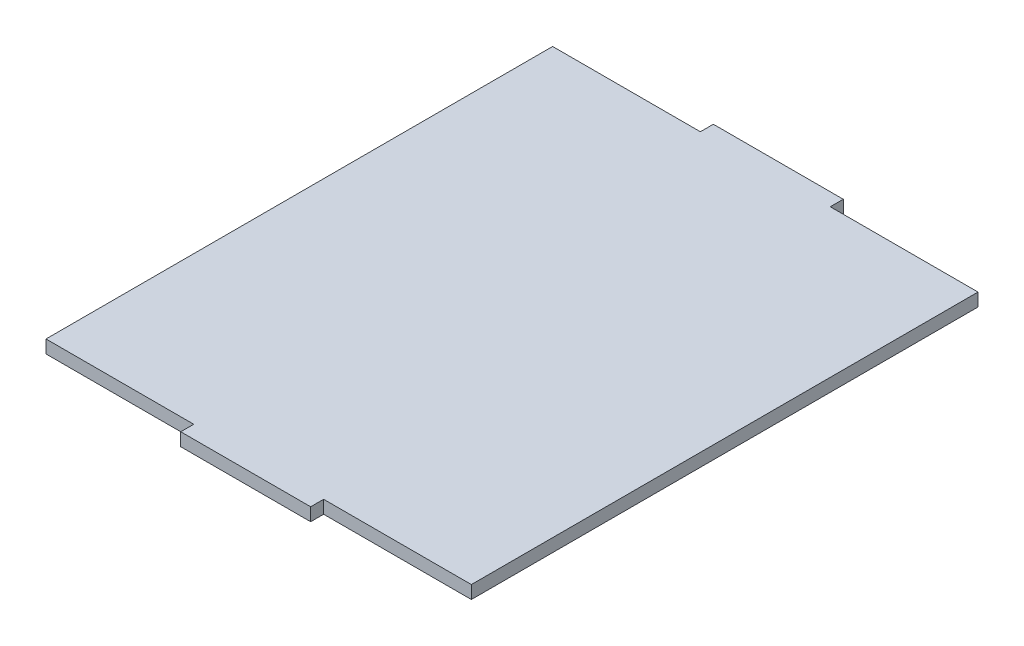
ISO-10303-21;
HEADER;
FILE_DESCRIPTION(('STEP AP214'),'2;1');
FILE_NAME('part.step','',(''),(''),'','','');
FILE_SCHEMA(('AUTOMOTIVE_DESIGN { 1 0 10303 214 1 1 1 1 }'));
ENDSEC;
DATA;
#1=APPLICATION_CONTEXT('core data for automotive mechanical design processes');
#2=APPLICATION_PROTOCOL_DEFINITION('international standard','automotive_design',2000,#1);
#3=PRODUCT_CONTEXT('',#1,'mechanical');
#4=PRODUCT('Part','Part','',(#3));
#5=PRODUCT_RELATED_PRODUCT_CATEGORY('part','',(#4));
#6=PRODUCT_DEFINITION_FORMATION('','',#4);
#7=PRODUCT_DEFINITION_CONTEXT('part definition',#1,'design');
#8=PRODUCT_DEFINITION('design','',#6,#7);
#9=PRODUCT_DEFINITION_SHAPE('','',#8);
#10=(LENGTH_UNIT() NAMED_UNIT(*) SI_UNIT(.MILLI.,.METRE.));
#11=(NAMED_UNIT(*) PLANE_ANGLE_UNIT() SI_UNIT($,.RADIAN.));
#12=(NAMED_UNIT(*) SI_UNIT($,.STERADIAN.) SOLID_ANGLE_UNIT());
#13=UNCERTAINTY_MEASURE_WITH_UNIT(LENGTH_MEASURE(1.E-05),#10,'distance_accuracy_value','');
#14=(GEOMETRIC_REPRESENTATION_CONTEXT(3) GLOBAL_UNCERTAINTY_ASSIGNED_CONTEXT((#13)) GLOBAL_UNIT_ASSIGNED_CONTEXT((#10,
#11,#12)) REPRESENTATION_CONTEXT('',''));
#15=CARTESIAN_POINT('',(0.,0.,0.));
#16=DIRECTION('',(0.,0.,1.));
#17=DIRECTION('',(1.,0.,0.));
#18=AXIS2_PLACEMENT_3D('',#15,#16,#17);
#19=CARTESIAN_POINT('',(-60.5023781779952,3.,-76.3083130287571));
#20=DIRECTION('',(1.,0.,0.));
#21=DIRECTION('',(0.,0.,-1.));
#22=AXIS2_PLACEMENT_3D('',#19,#20,#21);
#23=PLANE('',#22);
#24=DIRECTION('',(0.,0.,1.));
#25=VECTOR('',#24,1.);
#26=CARTESIAN_POINT('',(-60.5023781779952,0.,-76.3083130287571));
#27=LINE('',#26,#25);
#28=CARTESIAN_POINT('',(-60.5023781779952,0.,-76.3083130287571));
#29=VERTEX_POINT('',#28);
#30=CARTESIAN_POINT('',(-60.5023781779952,0.,40.691686971243));
#31=VERTEX_POINT('',#30);
#32=EDGE_CURVE('E153',#29,#31,#27,.T.);
#33=ORIENTED_EDGE('',*,*,#32,.T.);
#34=DIRECTION('',(0.,-1.,0.));
#35=VECTOR('',#34,1.);
#36=CARTESIAN_POINT('',(-60.5023781779952,3.,40.691686971243));
#37=LINE('',#36,#35);
#38=CARTESIAN_POINT('',(-60.5023781779952,3.,40.691686971243));
#39=VERTEX_POINT('',#38);
#40=EDGE_CURVE('E11',#39,#31,#37,.T.);
#41=ORIENTED_EDGE('',*,*,#40,.F.);
#42=DIRECTION('',(0.,0.,1.));
#43=VECTOR('',#42,1.);
#44=CARTESIAN_POINT('',(-60.5023781779952,3.,-76.3083130287571));
#45=LINE('',#44,#43);
#46=CARTESIAN_POINT('',(-60.5023781779952,3.,-76.3083130287571));
#47=VERTEX_POINT('',#46);
#48=EDGE_CURVE('E175',#47,#39,#45,.T.);
#49=ORIENTED_EDGE('',*,*,#48,.F.);
#50=DIRECTION('',(0.,-1.,0.));
#51=VECTOR('',#50,1.);
#52=CARTESIAN_POINT('',(-60.5023781779952,3.,-76.3083130287571));
#53=LINE('',#52,#51);
#54=EDGE_CURVE('E149',#47,#29,#53,.T.);
#55=ORIENTED_EDGE('',*,*,#54,.T.);
#56=EDGE_LOOP('',(#33,#41,#49,#55));
#57=FACE_BOUND('',#56,.T.);
#58=ADVANCED_FACE('F33',(#57),#23,.F.);
#59=CARTESIAN_POINT('',(-60.5023781779952,3.,40.691686971243));
#60=DIRECTION('',(0.,0.,-1.));
#61=DIRECTION('',(-1.,0.,0.));
#62=AXIS2_PLACEMENT_3D('',#59,#60,#61);
#63=PLANE('',#62);
#64=DIRECTION('',(1.,0.,0.));
#65=VECTOR('',#64,1.);
#66=CARTESIAN_POINT('',(-60.5023781779952,0.,40.691686971243));
#67=LINE('',#66,#65);
#68=CARTESIAN_POINT('',(-26.3873781779952,0.,40.691686971243));
#69=VERTEX_POINT('',#68);
#70=EDGE_CURVE('E156',#31,#69,#67,.T.);
#71=ORIENTED_EDGE('',*,*,#70,.T.);
#72=DIRECTION('',(0.,-1.,0.));
#73=VECTOR('',#72,1.);
#74=CARTESIAN_POINT('',(-26.3873781779952,3.,40.691686971243));
#75=LINE('',#74,#73);
#76=CARTESIAN_POINT('',(-26.3873781779952,3.,40.691686971243));
#77=VERTEX_POINT('',#76);
#78=EDGE_CURVE('E41',#77,#69,#75,.T.);
#79=ORIENTED_EDGE('',*,*,#78,.F.);
#80=DIRECTION('',(1.,0.,0.));
#81=VECTOR('',#80,1.);
#82=CARTESIAN_POINT('',(-60.5023781779952,3.,40.691686971243));
#83=LINE('',#82,#81);
#84=EDGE_CURVE('E104',#39,#77,#83,.T.);
#85=ORIENTED_EDGE('',*,*,#84,.F.);
#86=ORIENTED_EDGE('',*,*,#40,.T.);
#87=EDGE_LOOP('',(#71,#79,#85,#86));
#88=FACE_BOUND('',#87,.T.);
#89=ADVANCED_FACE('F253',(#88),#63,.F.);
#90=CARTESIAN_POINT('',(-26.3873781779952,3.,40.691686971243));
#91=DIRECTION('',(1.,0.,0.));
#92=DIRECTION('',(0.,0.,-1.));
#93=AXIS2_PLACEMENT_3D('',#90,#91,#92);
#94=PLANE('',#93);
#95=DIRECTION('',(0.,0.,1.));
#96=VECTOR('',#95,1.);
#97=CARTESIAN_POINT('',(-26.3873781779952,0.,40.691686971243));
#98=LINE('',#97,#96);
#99=CARTESIAN_POINT('',(-26.3873781779952,0.,43.691686971243));
#100=VERTEX_POINT('',#99);
#101=EDGE_CURVE('E158',#69,#100,#98,.T.);
#102=ORIENTED_EDGE('',*,*,#101,.T.);
#103=DIRECTION('',(0.,-1.,0.));
#104=VECTOR('',#103,1.);
#105=CARTESIAN_POINT('',(-26.3873781779952,3.,43.691686971243));
#106=LINE('',#105,#104);
#107=CARTESIAN_POINT('',(-26.3873781779952,3.,43.691686971243));
#108=VERTEX_POINT('',#107);
#109=EDGE_CURVE('E194',#108,#100,#106,.T.);
#110=ORIENTED_EDGE('',*,*,#109,.F.);
#111=DIRECTION('',(0.,0.,1.));
#112=VECTOR('',#111,1.);
#113=CARTESIAN_POINT('',(-26.3873781779952,3.,40.691686971243));
#114=LINE('',#113,#112);
#115=EDGE_CURVE('E202',#77,#108,#114,.T.);
#116=ORIENTED_EDGE('',*,*,#115,.F.);
#117=ORIENTED_EDGE('',*,*,#78,.T.);
#118=EDGE_LOOP('',(#102,#110,#116,#117));
#119=FACE_BOUND('',#118,.T.);
#120=ADVANCED_FACE('F200',(#119),#94,.F.);
#121=CARTESIAN_POINT('',(-26.3873781779952,3.,43.691686971243));
#122=DIRECTION('',(0.,0.,-1.));
#123=DIRECTION('',(-1.,0.,0.));
#124=AXIS2_PLACEMENT_3D('',#121,#122,#123);
#125=PLANE('',#124);
#126=DIRECTION('',(1.,0.,0.));
#127=VECTOR('',#126,1.);
#128=CARTESIAN_POINT('',(-26.3873781779952,0.,43.691686971243));
#129=LINE('',#128,#127);
#130=CARTESIAN_POINT('',(3.61262182200479,0.,43.691686971243));
#131=VERTEX_POINT('',#130);
#132=EDGE_CURVE('E160',#100,#131,#129,.T.);
#133=ORIENTED_EDGE('',*,*,#132,.T.);
#134=DIRECTION('',(0.,-1.,0.));
#135=VECTOR('',#134,1.);
#136=CARTESIAN_POINT('',(3.61262182200479,3.,43.691686971243));
#137=LINE('',#136,#135);
#138=CARTESIAN_POINT('',(3.61262182200479,3.,43.691686971243));
#139=VERTEX_POINT('',#138);
#140=EDGE_CURVE('E191',#139,#131,#137,.T.);
#141=ORIENTED_EDGE('',*,*,#140,.F.);
#142=DIRECTION('',(1.,0.,0.));
#143=VECTOR('',#142,1.);
#144=CARTESIAN_POINT('',(-26.3873781779952,3.,43.691686971243));
#145=LINE('',#144,#143);
#146=EDGE_CURVE('E220',#108,#139,#145,.T.);
#147=ORIENTED_EDGE('',*,*,#146,.F.);
#148=ORIENTED_EDGE('',*,*,#109,.T.);
#149=EDGE_LOOP('',(#133,#141,#147,#148));
#150=FACE_BOUND('',#149,.T.);
#151=ADVANCED_FACE('F211',(#150),#125,.F.);
#152=CARTESIAN_POINT('',(3.61262182200479,3.,40.691686971243));
#153=DIRECTION('',(-1.,0.,0.));
#154=DIRECTION('',(0.,0.,1.));
#155=AXIS2_PLACEMENT_3D('',#152,#153,#154);
#156=PLANE('',#155);
#157=DIRECTION('',(0.,0.,-1.));
#158=VECTOR('',#157,1.);
#159=CARTESIAN_POINT('',(3.61262182200479,0.,40.691686971243));
#160=LINE('',#159,#158);
#161=CARTESIAN_POINT('',(3.61262182200479,0.,40.691686971243));
#162=VERTEX_POINT('',#161);
#163=EDGE_CURVE('E162',#131,#162,#160,.T.);
#164=ORIENTED_EDGE('',*,*,#163,.T.);
#165=DIRECTION('',(0.,-1.,0.));
#166=VECTOR('',#165,1.);
#167=CARTESIAN_POINT('',(3.61262182200479,3.,40.691686971243));
#168=LINE('',#167,#166);
#169=CARTESIAN_POINT('',(3.61262182200479,3.,40.691686971243));
#170=VERTEX_POINT('',#169);
#171=EDGE_CURVE('E188',#170,#162,#168,.T.);
#172=ORIENTED_EDGE('',*,*,#171,.F.);
#173=DIRECTION('',(0.,0.,-1.));
#174=VECTOR('',#173,1.);
#175=CARTESIAN_POINT('',(3.61262182200479,3.,40.691686971243));
#176=LINE('',#175,#174);
#177=EDGE_CURVE('E217',#139,#170,#176,.T.);
#178=ORIENTED_EDGE('',*,*,#177,.F.);
#179=ORIENTED_EDGE('',*,*,#140,.T.);
#180=EDGE_LOOP('',(#164,#172,#178,#179));
#181=FACE_BOUND('',#180,.T.);
#182=ADVANCED_FACE('F215',(#181),#156,.F.);
#183=CARTESIAN_POINT('',(3.61262182200479,3.,40.691686971243));
#184=DIRECTION('',(0.,0.,-1.));
#185=DIRECTION('',(-1.,0.,0.));
#186=AXIS2_PLACEMENT_3D('',#183,#184,#185);
#187=PLANE('',#186);
#188=DIRECTION('',(1.,0.,0.));
#189=VECTOR('',#188,1.);
#190=CARTESIAN_POINT('',(3.61262182200479,0.,40.691686971243));
#191=LINE('',#190,#189);
#192=CARTESIAN_POINT('',(37.7276218220048,0.,40.691686971243));
#193=VERTEX_POINT('',#192);
#194=EDGE_CURVE('E164',#162,#193,#191,.T.);
#195=ORIENTED_EDGE('',*,*,#194,.T.);
#196=DIRECTION('',(0.,-1.,0.));
#197=VECTOR('',#196,1.);
#198=CARTESIAN_POINT('',(37.7276218220048,3.,40.691686971243));
#199=LINE('',#198,#197);
#200=CARTESIAN_POINT('',(37.7276218220048,3.,40.691686971243));
#201=VERTEX_POINT('',#200);
#202=EDGE_CURVE('E185',#201,#193,#199,.T.);
#203=ORIENTED_EDGE('',*,*,#202,.F.);
#204=DIRECTION('',(1.,0.,0.));
#205=VECTOR('',#204,1.);
#206=CARTESIAN_POINT('',(3.61262182200479,3.,40.691686971243));
#207=LINE('',#206,#205);
#208=EDGE_CURVE('E219',#170,#201,#207,.T.);
#209=ORIENTED_EDGE('',*,*,#208,.F.);
#210=ORIENTED_EDGE('',*,*,#171,.T.);
#211=EDGE_LOOP('',(#195,#203,#209,#210));
#212=FACE_BOUND('',#211,.T.);
#213=ADVANCED_FACE('F266',(#212),#187,.F.);
#214=CARTESIAN_POINT('',(37.7276218220048,3.,-76.3083130287571));
#215=DIRECTION('',(-1.,0.,0.));
#216=DIRECTION('',(0.,0.,1.));
#217=AXIS2_PLACEMENT_3D('',#214,#215,#216);
#218=PLANE('',#217);
#219=DIRECTION('',(0.,0.,-1.));
#220=VECTOR('',#219,1.);
#221=CARTESIAN_POINT('',(37.7276218220048,0.,-76.3083130287571));
#222=LINE('',#221,#220);
#223=CARTESIAN_POINT('',(37.7276218220048,0.,-76.3083130287571));
#224=VERTEX_POINT('',#223);
#225=EDGE_CURVE('E166',#193,#224,#222,.T.);
#226=ORIENTED_EDGE('',*,*,#225,.T.);
#227=DIRECTION('',(0.,-1.,0.));
#228=VECTOR('',#227,1.);
#229=CARTESIAN_POINT('',(37.7276218220048,3.,-76.3083130287571));
#230=LINE('',#229,#228);
#231=CARTESIAN_POINT('',(37.7276218220048,3.,-76.3083130287571));
#232=VERTEX_POINT('',#231);
#233=EDGE_CURVE('E182',#232,#224,#230,.T.);
#234=ORIENTED_EDGE('',*,*,#233,.F.);
#235=DIRECTION('',(0.,0.,-1.));
#236=VECTOR('',#235,1.);
#237=CARTESIAN_POINT('',(37.7276218220048,3.,-76.3083130287571));
#238=LINE('',#237,#236);
#239=EDGE_CURVE('E222',#201,#232,#238,.T.);
#240=ORIENTED_EDGE('',*,*,#239,.F.);
#241=ORIENTED_EDGE('',*,*,#202,.T.);
#242=EDGE_LOOP('',(#226,#234,#240,#241));
#243=FACE_BOUND('',#242,.T.);
#244=ADVANCED_FACE('F269',(#243),#218,.F.);
#245=CARTESIAN_POINT('',(3.61262182200475,3.,-76.3083130287571));
#246=DIRECTION('',(0.,0.,1.));
#247=DIRECTION('',(1.,0.,0.));
#248=AXIS2_PLACEMENT_3D('',#245,#246,#247);
#249=PLANE('',#248);
#250=DIRECTION('',(-1.,0.,0.));
#251=VECTOR('',#250,1.);
#252=CARTESIAN_POINT('',(3.61262182200475,0.,-76.3083130287571));
#253=LINE('',#252,#251);
#254=CARTESIAN_POINT('',(3.61262182200475,0.,-76.3083130287571));
#255=VERTEX_POINT('',#254);
#256=EDGE_CURVE('E168',#224,#255,#253,.T.);
#257=ORIENTED_EDGE('',*,*,#256,.T.);
#258=DIRECTION('',(0.,-1.,0.));
#259=VECTOR('',#258,1.);
#260=CARTESIAN_POINT('',(3.61262182200475,3.,-76.3083130287571));
#261=LINE('',#260,#259);
#262=CARTESIAN_POINT('',(3.61262182200475,3.,-76.3083130287571));
#263=VERTEX_POINT('',#262);
#264=EDGE_CURVE('E179',#263,#255,#261,.T.);
#265=ORIENTED_EDGE('',*,*,#264,.F.);
#266=DIRECTION('',(-1.,0.,0.));
#267=VECTOR('',#266,1.);
#268=CARTESIAN_POINT('',(3.61262182200475,3.,-76.3083130287571));
#269=LINE('',#268,#267);
#270=EDGE_CURVE('E228',#232,#263,#269,.T.);
#271=ORIENTED_EDGE('',*,*,#270,.F.);
#272=ORIENTED_EDGE('',*,*,#233,.T.);
#273=EDGE_LOOP('',(#257,#265,#271,#272));
#274=FACE_BOUND('',#273,.T.);
#275=ADVANCED_FACE('F234',(#274),#249,.F.);
#276=CARTESIAN_POINT('',(3.61262182200475,3.,-79.3083130287571));
#277=DIRECTION('',(-1.,0.,0.));
#278=DIRECTION('',(0.,0.,1.));
#279=AXIS2_PLACEMENT_3D('',#276,#277,#278);
#280=PLANE('',#279);
#281=DIRECTION('',(0.,0.,-1.));
#282=VECTOR('',#281,1.);
#283=CARTESIAN_POINT('',(3.61262182200475,0.,-79.3083130287571));
#284=LINE('',#283,#282);
#285=CARTESIAN_POINT('',(3.61262182200475,0.,-79.3083130287571));
#286=VERTEX_POINT('',#285);
#287=EDGE_CURVE('E170',#255,#286,#284,.T.);
#288=ORIENTED_EDGE('',*,*,#287,.T.);
#289=DIRECTION('',(0.,-1.,0.));
#290=VECTOR('',#289,1.);
#291=CARTESIAN_POINT('',(3.61262182200475,3.,-79.3083130287571));
#292=LINE('',#291,#290);
#293=CARTESIAN_POINT('',(3.61262182200475,3.,-79.3083130287571));
#294=VERTEX_POINT('',#293);
#295=EDGE_CURVE('E144',#294,#286,#292,.T.);
#296=ORIENTED_EDGE('',*,*,#295,.F.);
#297=DIRECTION('',(0.,0.,-1.));
#298=VECTOR('',#297,1.);
#299=CARTESIAN_POINT('',(3.61262182200475,3.,-79.3083130287571));
#300=LINE('',#299,#298);
#301=EDGE_CURVE('E135',#263,#294,#300,.T.);
#302=ORIENTED_EDGE('',*,*,#301,.F.);
#303=ORIENTED_EDGE('',*,*,#264,.T.);
#304=EDGE_LOOP('',(#288,#296,#302,#303));
#305=FACE_BOUND('',#304,.T.);
#306=ADVANCED_FACE('F238',(#305),#280,.F.);
#307=CARTESIAN_POINT('',(-26.3873781779952,3.,-79.3083130287571));
#308=DIRECTION('',(0.,0.,1.));
#309=DIRECTION('',(1.,0.,0.));
#310=AXIS2_PLACEMENT_3D('',#307,#308,#309);
#311=PLANE('',#310);
#312=DIRECTION('',(-1.,0.,0.));
#313=VECTOR('',#312,1.);
#314=CARTESIAN_POINT('',(-26.3873781779952,0.,-79.3083130287571));
#315=LINE('',#314,#313);
#316=CARTESIAN_POINT('',(-26.3873781779952,0.,-79.3083130287571));
#317=VERTEX_POINT('',#316);
#318=EDGE_CURVE('E143',#286,#317,#315,.T.);
#319=ORIENTED_EDGE('',*,*,#318,.T.);
#320=DIRECTION('',(0.,-1.,0.));
#321=VECTOR('',#320,1.);
#322=CARTESIAN_POINT('',(-26.3873781779952,3.,-79.3083130287571));
#323=LINE('',#322,#321);
#324=CARTESIAN_POINT('',(-26.3873781779952,3.,-79.3083130287571));
#325=VERTEX_POINT('',#324);
#326=EDGE_CURVE('E140',#325,#317,#323,.T.);
#327=ORIENTED_EDGE('',*,*,#326,.F.);
#328=DIRECTION('',(-1.,0.,0.));
#329=VECTOR('',#328,1.);
#330=CARTESIAN_POINT('',(-26.3873781779952,3.,-79.3083130287571));
#331=LINE('',#330,#329);
#332=EDGE_CURVE('E129',#294,#325,#331,.T.);
#333=ORIENTED_EDGE('',*,*,#332,.F.);
#334=ORIENTED_EDGE('',*,*,#295,.T.);
#335=EDGE_LOOP('',(#319,#327,#333,#334));
#336=FACE_BOUND('',#335,.T.);
#337=ADVANCED_FACE('F141',(#336),#311,.F.);
#338=CARTESIAN_POINT('',(-26.3873781779952,3.,-79.3083130287571));
#339=DIRECTION('',(1.,0.,0.));
#340=DIRECTION('',(0.,0.,-1.));
#341=AXIS2_PLACEMENT_3D('',#338,#339,#340);
#342=PLANE('',#341);
#343=DIRECTION('',(0.,0.,1.));
#344=VECTOR('',#343,1.);
#345=CARTESIAN_POINT('',(-26.3873781779952,0.,-79.3083130287571));
#346=LINE('',#345,#344);
#347=CARTESIAN_POINT('',(-26.3873781779952,0.,-76.3083130287571));
#348=VERTEX_POINT('',#347);
#349=EDGE_CURVE('E90',#317,#348,#346,.T.);
#350=ORIENTED_EDGE('',*,*,#349,.T.);
#351=DIRECTION('',(0.,-1.,0.));
#352=VECTOR('',#351,1.);
#353=CARTESIAN_POINT('',(-26.3873781779952,3.,-76.3083130287571));
#354=LINE('',#353,#352);
#355=CARTESIAN_POINT('',(-26.3873781779952,3.,-76.3083130287571));
#356=VERTEX_POINT('',#355);
#357=EDGE_CURVE('E145',#356,#348,#354,.T.);
#358=ORIENTED_EDGE('',*,*,#357,.F.);
#359=DIRECTION('',(0.,0.,1.));
#360=VECTOR('',#359,1.);
#361=CARTESIAN_POINT('',(-26.3873781779952,3.,-79.3083130287571));
#362=LINE('',#361,#360);
#363=EDGE_CURVE('E133',#325,#356,#362,.T.);
#364=ORIENTED_EDGE('',*,*,#363,.F.);
#365=ORIENTED_EDGE('',*,*,#326,.T.);
#366=EDGE_LOOP('',(#350,#358,#364,#365));
#367=FACE_BOUND('',#366,.T.);
#368=ADVANCED_FACE('F147',(#367),#342,.F.);
#369=CARTESIAN_POINT('',(-60.5023781779952,3.,-76.3083130287571));
#370=DIRECTION('',(0.,0.,1.));
#371=DIRECTION('',(1.,0.,0.));
#372=AXIS2_PLACEMENT_3D('',#369,#370,#371);
#373=PLANE('',#372);
#374=DIRECTION('',(-1.,0.,0.));
#375=VECTOR('',#374,1.);
#376=CARTESIAN_POINT('',(-60.5023781779952,0.,-76.3083130287571));
#377=LINE('',#376,#375);
#378=EDGE_CURVE('E96',#348,#29,#377,.T.);
#379=ORIENTED_EDGE('',*,*,#378,.T.);
#380=ORIENTED_EDGE('',*,*,#54,.F.);
#381=DIRECTION('',(-1.,0.,0.));
#382=VECTOR('',#381,1.);
#383=CARTESIAN_POINT('',(-60.5023781779952,3.,-76.3083130287571));
#384=LINE('',#383,#382);
#385=EDGE_CURVE('E49',#356,#47,#384,.T.);
#386=ORIENTED_EDGE('',*,*,#385,.F.);
#387=ORIENTED_EDGE('',*,*,#357,.T.);
#388=EDGE_LOOP('',(#379,#380,#386,#387));
#389=FACE_BOUND('',#388,.T.);
#390=ADVANCED_FACE('F242',(#389),#373,.F.);
#391=CARTESIAN_POINT('',(0.,3.,0.));
#392=DIRECTION('',(0.,1.,0.));
#393=DIRECTION('',(0.,0.,1.));
#394=AXIS2_PLACEMENT_3D('',#391,#392,#393);
#395=PLANE('',#394);
#396=ORIENTED_EDGE('',*,*,#48,.T.);
#397=ORIENTED_EDGE('',*,*,#84,.T.);
#398=ORIENTED_EDGE('',*,*,#115,.T.);
#399=ORIENTED_EDGE('',*,*,#146,.T.);
#400=ORIENTED_EDGE('',*,*,#177,.T.);
#401=ORIENTED_EDGE('',*,*,#208,.T.);
#402=ORIENTED_EDGE('',*,*,#239,.T.);
#403=ORIENTED_EDGE('',*,*,#270,.T.);
#404=ORIENTED_EDGE('',*,*,#301,.T.);
#405=ORIENTED_EDGE('',*,*,#332,.T.);
#406=ORIENTED_EDGE('',*,*,#363,.T.);
#407=ORIENTED_EDGE('',*,*,#385,.T.);
#408=EDGE_LOOP('',(#396,#397,#398,#399,#400,#401,#402,#403,#404,#405,#406,#407));
#409=FACE_BOUND('',#408,.T.);
#410=ADVANCED_FACE('F131',(#409),#395,.T.);
#411=CARTESIAN_POINT('',(0.,0.,0.));
#412=DIRECTION('',(0.,1.,0.));
#413=DIRECTION('',(0.,0.,1.));
#414=AXIS2_PLACEMENT_3D('',#411,#412,#413);
#415=PLANE('',#414);
#416=ORIENTED_EDGE('',*,*,#32,.F.);
#417=ORIENTED_EDGE('',*,*,#378,.F.);
#418=ORIENTED_EDGE('',*,*,#349,.F.);
#419=ORIENTED_EDGE('',*,*,#318,.F.);
#420=ORIENTED_EDGE('',*,*,#287,.F.);
#421=ORIENTED_EDGE('',*,*,#256,.F.);
#422=ORIENTED_EDGE('',*,*,#225,.F.);
#423=ORIENTED_EDGE('',*,*,#194,.F.);
#424=ORIENTED_EDGE('',*,*,#163,.F.);
#425=ORIENTED_EDGE('',*,*,#132,.F.);
#426=ORIENTED_EDGE('',*,*,#101,.F.);
#427=ORIENTED_EDGE('',*,*,#70,.F.);
#428=EDGE_LOOP('',(#416,#417,#418,#419,#420,#421,#422,#423,#424,#425,#426,#427));
#429=FACE_BOUND('',#428,.T.);
#430=ADVANCED_FACE('F206',(#429),#415,.F.);
#431=CLOSED_SHELL('',(#58,#89,#120,#151,#182,#213,#244,#275,#306,#337,#368,#390,#410,#430));
#432=MANIFOLD_SOLID_BREP('B2',#431);
#433=ADVANCED_BREP_SHAPE_REPRESENTATION('',(#18,#432),#14);
#434=SHAPE_DEFINITION_REPRESENTATION(#9,#433);
ENDSEC;
END-ISO-10303-21;
